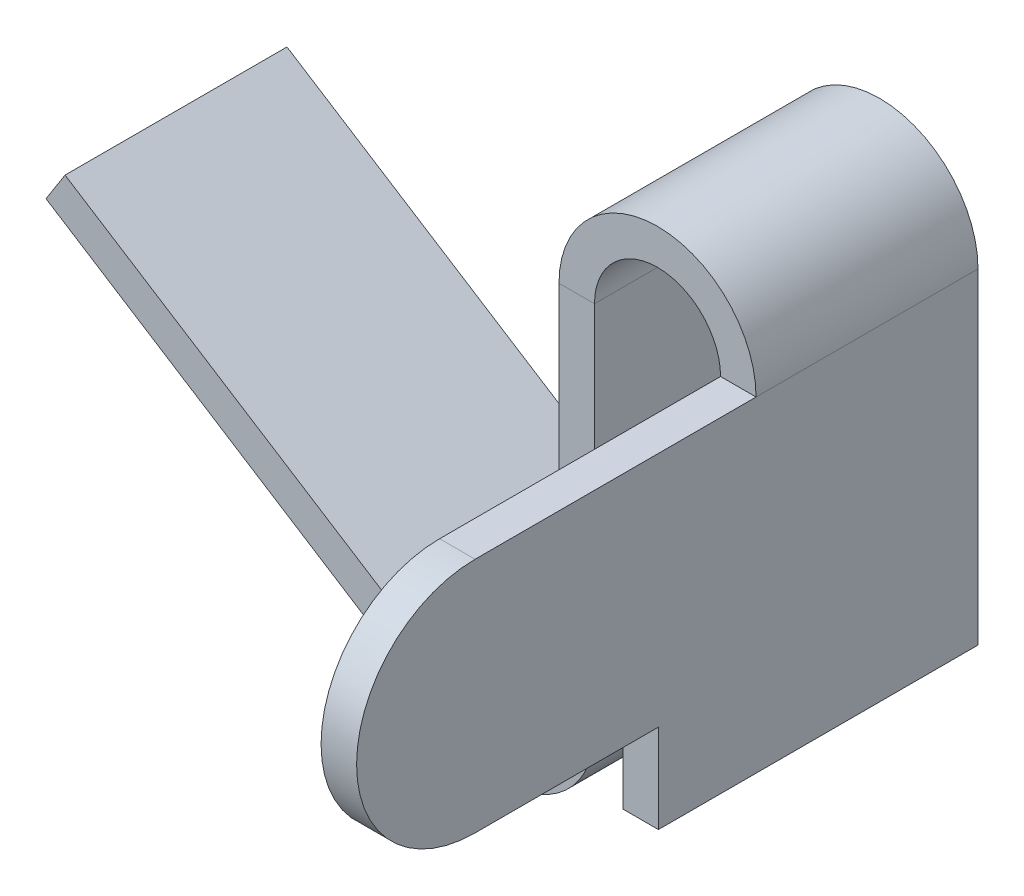
ISO-10303-21;
HEADER;
FILE_DESCRIPTION(('STEP AP214'),'2;1');
FILE_NAME('part.step','',(''),(''),'','','');
FILE_SCHEMA(('AUTOMOTIVE_DESIGN { 1 0 10303 214 1 1 1 1 }'));
ENDSEC;
DATA;
#1=APPLICATION_CONTEXT('core data for automotive mechanical design processes');
#2=APPLICATION_PROTOCOL_DEFINITION('international standard','automotive_design',2000,#1);
#3=PRODUCT_CONTEXT('',#1,'mechanical');
#4=PRODUCT('Part','Part','',(#3));
#5=PRODUCT_RELATED_PRODUCT_CATEGORY('part','',(#4));
#6=PRODUCT_DEFINITION_FORMATION('','',#4);
#7=PRODUCT_DEFINITION_CONTEXT('part definition',#1,'design');
#8=PRODUCT_DEFINITION('design','',#6,#7);
#9=PRODUCT_DEFINITION_SHAPE('','',#8);
#10=(LENGTH_UNIT() NAMED_UNIT(*) SI_UNIT(.MILLI.,.METRE.));
#11=(NAMED_UNIT(*) PLANE_ANGLE_UNIT() SI_UNIT($,.RADIAN.));
#12=(NAMED_UNIT(*) SI_UNIT($,.STERADIAN.) SOLID_ANGLE_UNIT());
#13=UNCERTAINTY_MEASURE_WITH_UNIT(LENGTH_MEASURE(1.E-05),#10,'distance_accuracy_value','');
#14=(GEOMETRIC_REPRESENTATION_CONTEXT(3) GLOBAL_UNCERTAINTY_ASSIGNED_CONTEXT((#13)) GLOBAL_UNIT_ASSIGNED_CONTEXT((#10,
#11,#12)) REPRESENTATION_CONTEXT('',''));
#15=CARTESIAN_POINT('',(0.,0.,0.));
#16=DIRECTION('',(0.,0.,1.));
#17=DIRECTION('',(1.,0.,0.));
#18=AXIS2_PLACEMENT_3D('',#15,#16,#17);
#19=CARTESIAN_POINT('',(20.1054210139582,7.32068373455989,39.1192773370868));
#20=DIRECTION('',(-1.,0.,0.));
#21=DIRECTION('',(0.,-1.,0.));
#22=AXIS2_PLACEMENT_3D('',#19,#20,#21);
#23=CYLINDRICAL_SURFACE('',#22,13.35);
#24=DIRECTION('',(1.,0.,0.));
#25=VECTOR('',#24,1.);
#26=CARTESIAN_POINT('',(20.1054210139582,-6.02931626544012,39.1192773370868));
#27=LINE('',#26,#25);
#28=CARTESIAN_POINT('',(20.1054210139582,-6.02931626544012,39.1192773370868));
#29=VERTEX_POINT('',#28);
#30=CARTESIAN_POINT('',(16.1054210139582,-6.02931626544012,39.1192773370868));
#31=VERTEX_POINT('',#30);
#32=EDGE_CURVE('E216',#29,#31,#27,.F.);
#33=ORIENTED_EDGE('',*,*,#32,.F.);
#34=CARTESIAN_POINT('',(20.1054210139582,7.32068373455989,39.1192773370868));
#35=DIRECTION('',(-1.,0.,0.));
#36=DIRECTION('',(0.,-1.,0.));
#37=AXIS2_PLACEMENT_3D('',#34,#35,#36);
#38=CIRCLE('',#37,13.35);
#39=CARTESIAN_POINT('',(20.1054210139582,20.6706837345599,39.1192773370868));
#40=VERTEX_POINT('',#39);
#41=EDGE_CURVE('E52',#40,#29,#38,.F.);
#42=ORIENTED_EDGE('',*,*,#41,.F.);
#43=DIRECTION('',(1.,0.,0.));
#44=VECTOR('',#43,1.);
#45=CARTESIAN_POINT('',(20.1054210139582,20.6706837345599,39.1192773370868));
#46=LINE('',#45,#44);
#47=CARTESIAN_POINT('',(16.1054210139582,20.6706837345599,39.1192773370868));
#48=VERTEX_POINT('',#47);
#49=EDGE_CURVE('E219',#48,#40,#46,.T.);
#50=ORIENTED_EDGE('',*,*,#49,.F.);
#51=CARTESIAN_POINT('',(16.1054210139582,7.32068373455989,39.1192773370868));
#52=DIRECTION('',(-1.,0.,0.));
#53=DIRECTION('',(0.,-1.,0.));
#54=AXIS2_PLACEMENT_3D('',#51,#52,#53);
#55=CIRCLE('',#54,13.35);
#56=EDGE_CURVE('E11',#31,#48,#55,.T.);
#57=ORIENTED_EDGE('',*,*,#56,.F.);
#58=EDGE_LOOP('',(#33,#42,#50,#57));
#59=FACE_BOUND('',#58,.T.);
#60=ADVANCED_FACE('F45',(#59),#23,.T.);
#61=CARTESIAN_POINT('',(1.90542101395821,20.6706837345599,7.46927733708683));
#62=DIRECTION('',(0.,0.,1.));
#63=DIRECTION('',(1.,0.,0.));
#64=AXIS2_PLACEMENT_3D('',#61,#62,#63);
#65=PLANE('',#64);
#66=DIRECTION('',(-1.,0.,0.));
#67=VECTOR('',#66,1.);
#68=CARTESIAN_POINT('',(1.90542101395821,20.6706837345599,7.46927733708683));
#69=LINE('',#68,#67);
#70=CARTESIAN_POINT('',(1.90542101395821,20.6706837345599,7.46927733708683));
#71=VERTEX_POINT('',#70);
#72=CARTESIAN_POINT('',(-2.09457898604179,20.6706837345599,7.46927733708683));
#73=VERTEX_POINT('',#72);
#74=EDGE_CURVE('E214',#71,#73,#69,.T.);
#75=ORIENTED_EDGE('',*,*,#74,.F.);
#76=CARTESIAN_POINT('',(9.00542101395822,20.6706837345599,7.46927733708683));
#77=DIRECTION('',(0.,0.,1.));
#78=DIRECTION('',(1.,0.,0.));
#79=AXIS2_PLACEMENT_3D('',#76,#77,#78);
#80=CIRCLE('',#79,7.10000000000001);
#81=CARTESIAN_POINT('',(16.1054210139582,20.6706837345599,7.46927733708683));
#82=VERTEX_POINT('',#81);
#83=EDGE_CURVE('E249',#82,#71,#80,.T.);
#84=ORIENTED_EDGE('',*,*,#83,.F.);
#85=DIRECTION('',(-1.,0.,0.));
#86=VECTOR('',#85,1.);
#87=CARTESIAN_POINT('',(20.1054210139582,20.6706837345599,7.46927733708683));
#88=LINE('',#87,#86);
#89=CARTESIAN_POINT('',(20.1054210139582,20.6706837345599,7.46927733708683));
#90=VERTEX_POINT('',#89);
#91=EDGE_CURVE('E211',#90,#82,#88,.T.);
#92=ORIENTED_EDGE('',*,*,#91,.F.);
#93=CARTESIAN_POINT('',(9.00542101395822,20.6706837345599,7.46927733708683));
#94=DIRECTION('',(0.,0.,1.));
#95=DIRECTION('',(1.,0.,0.));
#96=AXIS2_PLACEMENT_3D('',#93,#94,#95);
#97=CIRCLE('',#96,11.1);
#98=EDGE_CURVE('E252',#90,#73,#97,.T.);
#99=ORIENTED_EDGE('',*,*,#98,.T.);
#100=EDGE_LOOP('',(#75,#84,#92,#99));
#101=FACE_BOUND('',#100,.T.);
#102=ADVANCED_FACE('F348',(#101),#65,.T.);
#103=CARTESIAN_POINT('',(20.1054210139582,20.6706837345599,7.46927733708683));
#104=DIRECTION('',(0.,0.,1.));
#105=DIRECTION('',(1.,0.,0.));
#106=AXIS2_PLACEMENT_3D('',#103,#104,#105);
#107=PLANE('',#106);
#108=DIRECTION('',(0.,-1.,0.));
#109=VECTOR('',#108,1.);
#110=CARTESIAN_POINT('',(1.90542101395822,-21.0293162654401,7.46927733708683));
#111=LINE('',#110,#109);
#112=CARTESIAN_POINT('',(1.90542101395822,-21.0293162654401,7.46927733708683));
#113=VERTEX_POINT('',#112);
#114=EDGE_CURVE('E246',#71,#113,#111,.T.);
#115=ORIENTED_EDGE('',*,*,#114,.F.);
#116=ORIENTED_EDGE('',*,*,#74,.T.);
#117=DIRECTION('',(0.,-1.,0.));
#118=VECTOR('',#117,1.);
#119=CARTESIAN_POINT('',(-2.09457898604178,-21.0293162654401,7.46927733708683));
#120=LINE('',#119,#118);
#121=CARTESIAN_POINT('',(-2.09457898604178,-21.0293162654401,7.46927733708683));
#122=VERTEX_POINT('',#121);
#123=EDGE_CURVE('E255',#73,#122,#120,.T.);
#124=ORIENTED_EDGE('',*,*,#123,.T.);
#125=DIRECTION('',(1.,0.,0.));
#126=VECTOR('',#125,1.);
#127=CARTESIAN_POINT('',(-2.09457898604178,-21.0293162654401,7.46927733708683));
#128=LINE('',#127,#126);
#129=EDGE_CURVE('E203',#122,#113,#128,.T.);
#130=ORIENTED_EDGE('',*,*,#129,.T.);
#131=EDGE_LOOP('',(#115,#116,#124,#130));
#132=FACE_BOUND('',#131,.T.);
#133=ADVANCED_FACE('F344',(#132),#107,.T.);
#134=CARTESIAN_POINT('',(16.1054210139582,20.6706837345599,-17.5307226629132));
#135=DIRECTION('',(0.,0.,-1.));
#136=DIRECTION('',(-1.,0.,0.));
#137=AXIS2_PLACEMENT_3D('',#134,#135,#136);
#138=PLANE('',#137);
#139=DIRECTION('',(1.,0.,0.));
#140=VECTOR('',#139,1.);
#141=CARTESIAN_POINT('',(16.1054210139582,20.6706837345599,-17.5307226629132));
#142=LINE('',#141,#140);
#143=CARTESIAN_POINT('',(16.1054210139582,20.6706837345599,-17.5307226629132));
#144=VERTEX_POINT('',#143);
#145=CARTESIAN_POINT('',(20.1054210139582,20.6706837345599,-17.5307226629132));
#146=VERTEX_POINT('',#145);
#147=EDGE_CURVE('E209',#144,#146,#142,.T.);
#148=ORIENTED_EDGE('',*,*,#147,.F.);
#149=CARTESIAN_POINT('',(9.00542101395822,20.6706837345599,-17.5307226629132));
#150=DIRECTION('',(0.,0.,1.));
#151=DIRECTION('',(1.,0.,0.));
#152=AXIS2_PLACEMENT_3D('',#149,#150,#151);
#153=CIRCLE('',#152,7.10000000000001);
#154=CARTESIAN_POINT('',(1.90542101395821,20.6706837345599,-17.5307226629132));
#155=VERTEX_POINT('',#154);
#156=EDGE_CURVE('E276',#144,#155,#153,.T.);
#157=ORIENTED_EDGE('',*,*,#156,.T.);
#158=DIRECTION('',(1.,0.,0.));
#159=VECTOR('',#158,1.);
#160=CARTESIAN_POINT('',(-2.09457898604179,20.6706837345599,-17.5307226629132));
#161=LINE('',#160,#159);
#162=CARTESIAN_POINT('',(-2.09457898604179,20.6706837345599,-17.5307226629132));
#163=VERTEX_POINT('',#162);
#164=EDGE_CURVE('E207',#163,#155,#161,.T.);
#165=ORIENTED_EDGE('',*,*,#164,.F.);
#166=CARTESIAN_POINT('',(9.00542101395822,20.6706837345599,-17.5307226629132));
#167=DIRECTION('',(0.,0.,1.));
#168=DIRECTION('',(1.,0.,0.));
#169=AXIS2_PLACEMENT_3D('',#166,#167,#168);
#170=CIRCLE('',#169,11.1);
#171=EDGE_CURVE('E285',#146,#163,#170,.T.);
#172=ORIENTED_EDGE('',*,*,#171,.F.);
#173=EDGE_LOOP('',(#148,#157,#165,#172));
#174=FACE_BOUND('',#173,.T.);
#175=ADVANCED_FACE('F352',(#174),#138,.T.);
#176=CARTESIAN_POINT('',(-2.09457898604179,20.6706837345599,-17.5307226629132));
#177=DIRECTION('',(0.,0.,-1.));
#178=DIRECTION('',(-1.,0.,0.));
#179=AXIS2_PLACEMENT_3D('',#176,#177,#178);
#180=PLANE('',#179);
#181=DIRECTION('',(0.,1.,0.));
#182=VECTOR('',#181,1.);
#183=CARTESIAN_POINT('',(16.1054210139582,-16.0293162654401,-17.5307226629132));
#184=LINE('',#183,#182);
#185=CARTESIAN_POINT('',(16.1054210139582,-16.0293162654401,-17.5307226629132));
#186=VERTEX_POINT('',#185);
#187=EDGE_CURVE('E279',#186,#144,#184,.T.);
#188=ORIENTED_EDGE('',*,*,#187,.T.);
#189=ORIENTED_EDGE('',*,*,#147,.T.);
#190=DIRECTION('',(0.,1.,0.));
#191=VECTOR('',#190,1.);
#192=CARTESIAN_POINT('',(20.1054210139582,-16.0293162654401,-17.5307226629132));
#193=LINE('',#192,#191);
#194=CARTESIAN_POINT('',(20.1054210139582,-16.0293162654401,-17.5307226629132));
#195=VERTEX_POINT('',#194);
#196=EDGE_CURVE('E283',#195,#146,#193,.T.);
#197=ORIENTED_EDGE('',*,*,#196,.F.);
#198=DIRECTION('',(-1.,0.,0.));
#199=VECTOR('',#198,1.);
#200=CARTESIAN_POINT('',(20.1054210139582,-16.0293162654401,-17.5307226629132));
#201=LINE('',#200,#199);
#202=EDGE_CURVE('E173',#195,#186,#201,.T.);
#203=ORIENTED_EDGE('',*,*,#202,.T.);
#204=EDGE_LOOP('',(#188,#189,#197,#203));
#205=FACE_BOUND('',#204,.T.);
#206=ADVANCED_FACE('F359',(#205),#180,.T.);
#207=CARTESIAN_POINT('',(-13.4572670918099,-29.4697887806642,7.46927733708683));
#208=DIRECTION('',(0.,0.,1.));
#209=DIRECTION('',(1.,0.,0.));
#210=AXIS2_PLACEMENT_3D('',#207,#208,#209);
#211=PLANE('',#210);
#212=DIRECTION('',(0.536268810576813,0.844047251522408,0.));
#213=VECTOR('',#212,1.);
#214=CARTESIAN_POINT('',(-13.4572670918099,-29.4697887806642,7.46927733708683));
#215=LINE('',#214,#213);
#216=CARTESIAN_POINT('',(-13.4572670918099,-29.4697887806642,7.46927733708683));
#217=VERTEX_POINT('',#216);
#218=CARTESIAN_POINT('',(-11.3121918495027,-26.0935997745746,7.46927733708683));
#219=VERTEX_POINT('',#218);
#220=EDGE_CURVE('E205',#217,#219,#215,.T.);
#221=ORIENTED_EDGE('',*,*,#220,.F.);
#222=CARTESIAN_POINT('',(-8.09457898604178,-21.0293162654401,7.46927733708683));
#223=DIRECTION('',(0.,0.,-1.));
#224=DIRECTION('',(-1.,0.,0.));
#225=AXIS2_PLACEMENT_3D('',#222,#223,#224);
#226=CIRCLE('',#225,10.);
#227=EDGE_CURVE('E243',#113,#217,#226,.T.);
#228=ORIENTED_EDGE('',*,*,#227,.F.);
#229=ORIENTED_EDGE('',*,*,#129,.F.);
#230=CARTESIAN_POINT('',(-8.09457898604178,-21.0293162654401,7.46927733708683));
#231=DIRECTION('',(0.,0.,1.));
#232=DIRECTION('',(1.,0.,0.));
#233=AXIS2_PLACEMENT_3D('',#230,#231,#232);
#234=CIRCLE('',#233,6.);
#235=EDGE_CURVE('E258',#122,#219,#234,.F.);
#236=ORIENTED_EDGE('',*,*,#235,.T.);
#237=EDGE_LOOP('',(#221,#228,#229,#236));
#238=FACE_BOUND('',#237,.T.);
#239=ADVANCED_FACE('F342',(#238),#211,.T.);
#240=CARTESIAN_POINT('',(-2.09457898604178,-21.0293162654401,7.46927733708683));
#241=DIRECTION('',(0.,0.,1.));
#242=DIRECTION('',(1.,0.,0.));
#243=AXIS2_PLACEMENT_3D('',#240,#241,#242);
#244=PLANE('',#243);
#245=DIRECTION('',(-0.844047251522407,0.536268810576813,0.));
#246=VECTOR('',#245,1.);
#247=CARTESIAN_POINT('',(-13.4572670918099,-29.4697887806642,7.46927733708683));
#248=LINE('',#247,#246);
#249=CARTESIAN_POINT('',(-59.8798659255423,0.0249958010605287,7.46927733708683));
#250=VERTEX_POINT('',#249);
#251=EDGE_CURVE('E240',#217,#250,#248,.T.);
#252=ORIENTED_EDGE('',*,*,#251,.F.);
#253=ORIENTED_EDGE('',*,*,#220,.T.);
#254=DIRECTION('',(-0.844047251522407,0.536268810576813,0.));
#255=VECTOR('',#254,1.);
#256=CARTESIAN_POINT('',(-11.3121918495027,-26.0935997745746,7.46927733708683));
#257=LINE('',#256,#255);
#258=CARTESIAN_POINT('',(-57.7347906832351,3.40118480715016,7.46927733708683));
#259=VERTEX_POINT('',#258);
#260=EDGE_CURVE('E234',#219,#259,#257,.T.);
#261=ORIENTED_EDGE('',*,*,#260,.T.);
#262=DIRECTION('',(0.536268810576812,0.844047251522408,0.));
#263=VECTOR('',#262,1.);
#264=CARTESIAN_POINT('',(-59.8798659255423,0.0249958010605287,7.46927733708683));
#265=LINE('',#264,#263);
#266=EDGE_CURVE('E236',#250,#259,#265,.T.);
#267=ORIENTED_EDGE('',*,*,#266,.F.);
#268=EDGE_LOOP('',(#252,#253,#261,#267));
#269=FACE_BOUND('',#268,.T.);
#270=ADVANCED_FACE('F340',(#269),#244,.T.);
#271=CARTESIAN_POINT('',(1.90542101395822,-21.0293162654401,-17.5307226629132));
#272=DIRECTION('',(0.,0.,-1.));
#273=DIRECTION('',(-1.,0.,0.));
#274=AXIS2_PLACEMENT_3D('',#271,#272,#273);
#275=PLANE('',#274);
#276=DIRECTION('',(-1.,0.,0.));
#277=VECTOR('',#276,1.);
#278=CARTESIAN_POINT('',(1.90542101395822,-21.0293162654401,-17.5307226629132));
#279=LINE('',#278,#277);
#280=CARTESIAN_POINT('',(1.90542101395822,-21.0293162654401,-17.5307226629132));
#281=VERTEX_POINT('',#280);
#282=CARTESIAN_POINT('',(-2.09457898604178,-21.0293162654401,-17.5307226629132));
#283=VERTEX_POINT('',#282);
#284=EDGE_CURVE('E201',#281,#283,#279,.T.);
#285=ORIENTED_EDGE('',*,*,#284,.F.);
#286=CARTESIAN_POINT('',(-8.09457898604178,-21.0293162654401,-17.5307226629132));
#287=DIRECTION('',(0.,0.,-1.));
#288=DIRECTION('',(-1.,0.,0.));
#289=AXIS2_PLACEMENT_3D('',#286,#287,#288);
#290=CIRCLE('',#289,10.);
#291=CARTESIAN_POINT('',(-13.4572670918099,-29.4697887806642,-17.5307226629132));
#292=VERTEX_POINT('',#291);
#293=EDGE_CURVE('E270',#281,#292,#290,.T.);
#294=ORIENTED_EDGE('',*,*,#293,.T.);
#295=DIRECTION('',(-0.536268810576813,-0.844047251522408,0.));
#296=VECTOR('',#295,1.);
#297=CARTESIAN_POINT('',(-11.3121918495027,-26.0935997745746,-17.5307226629132));
#298=LINE('',#297,#296);
#299=CARTESIAN_POINT('',(-11.3121918495027,-26.0935997745746,-17.5307226629132));
#300=VERTEX_POINT('',#299);
#301=EDGE_CURVE('E199',#300,#292,#298,.T.);
#302=ORIENTED_EDGE('',*,*,#301,.F.);
#303=CARTESIAN_POINT('',(-8.09457898604178,-21.0293162654401,-17.5307226629132));
#304=DIRECTION('',(0.,0.,1.));
#305=DIRECTION('',(1.,0.,0.));
#306=AXIS2_PLACEMENT_3D('',#303,#304,#305);
#307=CIRCLE('',#306,6.);
#308=EDGE_CURVE('E237',#283,#300,#307,.F.);
#309=ORIENTED_EDGE('',*,*,#308,.F.);
#310=EDGE_LOOP('',(#285,#294,#302,#309));
#311=FACE_BOUND('',#310,.T.);
#312=ADVANCED_FACE('F311',(#311),#275,.T.);
#313=CARTESIAN_POINT('',(-11.3121918495027,-26.0935997745746,-17.5307226629132));
#314=DIRECTION('',(0.,0.,-1.));
#315=DIRECTION('',(-1.,0.,0.));
#316=AXIS2_PLACEMENT_3D('',#313,#314,#315);
#317=PLANE('',#316);
#318=DIRECTION('',(0.,-1.,0.));
#319=VECTOR('',#318,1.);
#320=CARTESIAN_POINT('',(1.90542101395822,-21.0293162654401,-17.5307226629132));
#321=LINE('',#320,#319);
#322=EDGE_CURVE('E273',#155,#281,#321,.T.);
#323=ORIENTED_EDGE('',*,*,#322,.T.);
#324=ORIENTED_EDGE('',*,*,#284,.T.);
#325=DIRECTION('',(0.,-1.,0.));
#326=VECTOR('',#325,1.);
#327=CARTESIAN_POINT('',(-2.09457898604178,-21.0293162654401,-17.5307226629132));
#328=LINE('',#327,#326);
#329=EDGE_CURVE('E288',#163,#283,#328,.T.);
#330=ORIENTED_EDGE('',*,*,#329,.F.);
#331=ORIENTED_EDGE('',*,*,#164,.T.);
#332=EDGE_LOOP('',(#323,#324,#330,#331));
#333=FACE_BOUND('',#332,.T.);
#334=ADVANCED_FACE('F307',(#333),#317,.T.);
#335=CARTESIAN_POINT('',(-11.3121918495027,-26.0935997745746,7.46927733708683));
#336=DIRECTION('',(-0.536268810576813,-0.844047251522407,0.));
#337=DIRECTION('',(0.844047251522407,-0.536268810576813,0.));
#338=AXIS2_PLACEMENT_3D('',#335,#336,#337);
#339=PLANE('',#338);
#340=DIRECTION('',(-0.844047251522407,0.536268810576813,0.));
#341=VECTOR('',#340,1.);
#342=CARTESIAN_POINT('',(-11.3121918495027,-26.0935997745746,-17.5307226629132));
#343=LINE('',#342,#341);
#344=CARTESIAN_POINT('',(-57.7347906832351,3.40118480715016,-17.5307226629132));
#345=VERTEX_POINT('',#344);
#346=EDGE_CURVE('E233',#300,#345,#343,.T.);
#347=ORIENTED_EDGE('',*,*,#346,.T.);
#348=DIRECTION('',(0.,0.,-1.));
#349=VECTOR('',#348,1.);
#350=CARTESIAN_POINT('',(-57.7347906832351,3.40118480715016,7.46927733708683));
#351=LINE('',#350,#349);
#352=EDGE_CURVE('E197',#259,#345,#351,.T.);
#353=ORIENTED_EDGE('',*,*,#352,.F.);
#354=ORIENTED_EDGE('',*,*,#260,.F.);
#355=DIRECTION('',(0.,0.,-1.));
#356=VECTOR('',#355,1.);
#357=CARTESIAN_POINT('',(-11.3121918495027,-26.0935997745746,7.46927733708683));
#358=LINE('',#357,#356);
#359=EDGE_CURVE('E261',#219,#300,#358,.T.);
#360=ORIENTED_EDGE('',*,*,#359,.T.);
#361=EDGE_LOOP('',(#347,#353,#354,#360));
#362=FACE_BOUND('',#361,.T.);
#363=ADVANCED_FACE('F336',(#362),#339,.F.);
#364=CARTESIAN_POINT('',(-59.8798659255423,0.0249958010605287,7.46927733708683));
#365=DIRECTION('',(-0.844047251522408,0.536268810576812,0.));
#366=DIRECTION('',(-0.536268810576812,-0.844047251522408,0.));
#367=AXIS2_PLACEMENT_3D('',#364,#365,#366);
#368=PLANE('',#367);
#369=DIRECTION('',(0.536268810576812,0.844047251522408,0.));
#370=VECTOR('',#369,1.);
#371=CARTESIAN_POINT('',(-59.8798659255423,0.0249958010605287,-17.5307226629132));
#372=LINE('',#371,#370);
#373=CARTESIAN_POINT('',(-59.8798659255423,0.0249958010605287,-17.5307226629132));
#374=VERTEX_POINT('',#373);
#375=EDGE_CURVE('E264',#374,#345,#372,.T.);
#376=ORIENTED_EDGE('',*,*,#375,.F.);
#377=DIRECTION('',(0.,0.,-1.));
#378=VECTOR('',#377,1.);
#379=CARTESIAN_POINT('',(-59.8798659255423,0.0249958010605287,7.46927733708683));
#380=LINE('',#379,#378);
#381=EDGE_CURVE('E195',#250,#374,#380,.T.);
#382=ORIENTED_EDGE('',*,*,#381,.F.);
#383=ORIENTED_EDGE('',*,*,#266,.T.);
#384=ORIENTED_EDGE('',*,*,#352,.T.);
#385=EDGE_LOOP('',(#376,#382,#383,#384));
#386=FACE_BOUND('',#385,.T.);
#387=ADVANCED_FACE('F396',(#386),#368,.T.);
#388=CARTESIAN_POINT('',(-13.4572670918099,-29.4697887806642,7.46927733708683));
#389=DIRECTION('',(-0.536268810576813,-0.844047251522407,0.));
#390=DIRECTION('',(0.844047251522407,-0.536268810576813,0.));
#391=AXIS2_PLACEMENT_3D('',#388,#389,#390);
#392=PLANE('',#391);
#393=DIRECTION('',(-0.844047251522407,0.536268810576813,0.));
#394=VECTOR('',#393,1.);
#395=CARTESIAN_POINT('',(-13.4572670918099,-29.4697887806642,-17.5307226629132));
#396=LINE('',#395,#394);
#397=EDGE_CURVE('E267',#292,#374,#396,.T.);
#398=ORIENTED_EDGE('',*,*,#397,.F.);
#399=DIRECTION('',(0.,0.,-1.));
#400=VECTOR('',#399,1.);
#401=CARTESIAN_POINT('',(-13.4572670918099,-29.4697887806642,7.46927733708683));
#402=LINE('',#401,#400);
#403=EDGE_CURVE('E192',#217,#292,#402,.T.);
#404=ORIENTED_EDGE('',*,*,#403,.F.);
#405=ORIENTED_EDGE('',*,*,#251,.T.);
#406=ORIENTED_EDGE('',*,*,#381,.T.);
#407=EDGE_LOOP('',(#398,#404,#405,#406));
#408=FACE_BOUND('',#407,.T.);
#409=ADVANCED_FACE('F325',(#408),#392,.T.);
#410=CARTESIAN_POINT('',(-8.09457898604178,-21.0293162654401,7.46927733708683));
#411=DIRECTION('',(0.,0.,-1.));
#412=DIRECTION('',(-1.,0.,0.));
#413=AXIS2_PLACEMENT_3D('',#410,#411,#412);
#414=CYLINDRICAL_SURFACE('',#413,10.);
#415=ORIENTED_EDGE('',*,*,#293,.F.);
#416=DIRECTION('',(0.,0.,-1.));
#417=VECTOR('',#416,1.);
#418=CARTESIAN_POINT('',(1.90542101395822,-21.0293162654401,7.46927733708683));
#419=LINE('',#418,#417);
#420=EDGE_CURVE('E189',#113,#281,#419,.T.);
#421=ORIENTED_EDGE('',*,*,#420,.F.);
#422=ORIENTED_EDGE('',*,*,#227,.T.);
#423=ORIENTED_EDGE('',*,*,#403,.T.);
#424=EDGE_LOOP('',(#415,#421,#422,#423));
#425=FACE_BOUND('',#424,.T.);
#426=ADVANCED_FACE('F320',(#425),#414,.T.);
#427=CARTESIAN_POINT('',(1.90542101395822,-21.0293162654401,7.46927733708683));
#428=DIRECTION('',(1.,0.,0.));
#429=DIRECTION('',(0.,1.,0.));
#430=AXIS2_PLACEMENT_3D('',#427,#428,#429);
#431=PLANE('',#430);
#432=ORIENTED_EDGE('',*,*,#322,.F.);
#433=DIRECTION('',(0.,0.,-1.));
#434=VECTOR('',#433,1.);
#435=CARTESIAN_POINT('',(1.90542101395821,20.6706837345599,7.46927733708683));
#436=LINE('',#435,#434);
#437=EDGE_CURVE('E186',#71,#155,#436,.T.);
#438=ORIENTED_EDGE('',*,*,#437,.F.);
#439=ORIENTED_EDGE('',*,*,#114,.T.);
#440=ORIENTED_EDGE('',*,*,#420,.T.);
#441=EDGE_LOOP('',(#432,#438,#439,#440));
#442=FACE_BOUND('',#441,.T.);
#443=ADVANCED_FACE('F315',(#442),#431,.T.);
#444=CARTESIAN_POINT('',(9.00542101395822,20.6706837345599,7.46927733708683));
#445=DIRECTION('',(0.,0.,-1.));
#446=DIRECTION('',(-1.,0.,0.));
#447=AXIS2_PLACEMENT_3D('',#444,#445,#446);
#448=CYLINDRICAL_SURFACE('',#447,7.10000000000001);
#449=ORIENTED_EDGE('',*,*,#156,.F.);
#450=DIRECTION('',(0.,0.,-1.));
#451=VECTOR('',#450,1.);
#452=CARTESIAN_POINT('',(16.1054210139582,20.6706837345599,7.46927733708683));
#453=LINE('',#452,#451);
#454=EDGE_CURVE('E177',#82,#144,#453,.T.);
#455=ORIENTED_EDGE('',*,*,#454,.F.);
#456=ORIENTED_EDGE('',*,*,#83,.T.);
#457=ORIENTED_EDGE('',*,*,#437,.T.);
#458=EDGE_LOOP('',(#449,#455,#456,#457));
#459=FACE_BOUND('',#458,.T.);
#460=ADVANCED_FACE('F356',(#459),#448,.F.);
#461=CARTESIAN_POINT('',(16.1054210139582,-16.0293162654401,7.46927733708683));
#462=DIRECTION('',(-1.,0.,0.));
#463=DIRECTION('',(0.,-1.,0.));
#464=AXIS2_PLACEMENT_3D('',#461,#462,#463);
#465=PLANE('',#464);
#466=DIRECTION('',(0.,0.,-1.));
#467=VECTOR('',#466,1.);
#468=CARTESIAN_POINT('',(16.1054210139582,-6.02931626544012,7.46927733708683));
#469=LINE('',#468,#467);
#470=CARTESIAN_POINT('',(16.1054210139582,-6.02931626544012,18.4692773370868));
#471=VERTEX_POINT('',#470);
#472=EDGE_CURVE('E226',#31,#471,#469,.T.);
#473=ORIENTED_EDGE('',*,*,#472,.F.);
#474=ORIENTED_EDGE('',*,*,#56,.T.);
#475=DIRECTION('',(0.,0.,-1.));
#476=VECTOR('',#475,1.);
#477=CARTESIAN_POINT('',(16.1054210139582,20.6706837345599,52.4692773370868));
#478=LINE('',#477,#476);
#479=EDGE_CURVE('E230',#48,#82,#478,.T.);
#480=ORIENTED_EDGE('',*,*,#479,.T.);
#481=ORIENTED_EDGE('',*,*,#454,.T.);
#482=ORIENTED_EDGE('',*,*,#187,.F.);
#483=DIRECTION('',(0.,0.,-1.));
#484=VECTOR('',#483,1.);
#485=CARTESIAN_POINT('',(16.1054210139582,-16.0293162654401,7.46927733708683));
#486=LINE('',#485,#484);
#487=CARTESIAN_POINT('',(16.1054210139582,-16.0293162654401,18.4692773370868));
#488=VERTEX_POINT('',#487);
#489=EDGE_CURVE('E174',#488,#186,#486,.T.);
#490=ORIENTED_EDGE('',*,*,#489,.F.);
#491=DIRECTION('',(0.,-1.,0.));
#492=VECTOR('',#491,1.);
#493=CARTESIAN_POINT('',(16.1054210139582,-16.0293162654401,18.4692773370868));
#494=LINE('',#493,#492);
#495=EDGE_CURVE('E155',#471,#488,#494,.T.);
#496=ORIENTED_EDGE('',*,*,#495,.F.);
#497=EDGE_LOOP('',(#473,#474,#480,#481,#482,#490,#496));
#498=FACE_BOUND('',#497,.T.);
#499=ADVANCED_FACE('F360',(#498),#465,.T.);
#500=CARTESIAN_POINT('',(20.1054210139582,-16.0293162654401,7.46927733708683));
#501=DIRECTION('',(0.,-1.,0.));
#502=DIRECTION('',(0.,0.,-1.));
#503=AXIS2_PLACEMENT_3D('',#500,#501,#502);
#504=PLANE('',#503);
#505=DIRECTION('',(1.,0.,0.));
#506=VECTOR('',#505,1.);
#507=CARTESIAN_POINT('',(-59.8798659255423,-16.0293162654401,18.4692773370868));
#508=LINE('',#507,#506);
#509=CARTESIAN_POINT('',(20.1054210139582,-16.0293162654401,18.4692773370868));
#510=VERTEX_POINT('',#509);
#511=EDGE_CURVE('E148',#488,#510,#508,.T.);
#512=ORIENTED_EDGE('',*,*,#511,.F.);
#513=ORIENTED_EDGE('',*,*,#489,.T.);
#514=ORIENTED_EDGE('',*,*,#202,.F.);
#515=DIRECTION('',(0.,0.,-1.));
#516=VECTOR('',#515,1.);
#517=CARTESIAN_POINT('',(20.1054210139582,-16.0293162654401,7.46927733708683));
#518=LINE('',#517,#516);
#519=EDGE_CURVE('E166',#510,#195,#518,.T.);
#520=ORIENTED_EDGE('',*,*,#519,.F.);
#521=EDGE_LOOP('',(#512,#513,#514,#520));
#522=FACE_BOUND('',#521,.T.);
#523=ADVANCED_FACE('F171',(#522),#504,.T.);
#524=CARTESIAN_POINT('',(20.1054210139582,-16.0293162654401,7.46927733708683));
#525=DIRECTION('',(-1.,0.,0.));
#526=DIRECTION('',(0.,-1.,0.));
#527=AXIS2_PLACEMENT_3D('',#524,#525,#526);
#528=PLANE('',#527);
#529=DIRECTION('',(0.,0.,-1.));
#530=VECTOR('',#529,1.);
#531=CARTESIAN_POINT('',(20.1054210139582,20.6706837345599,52.4692773370868));
#532=LINE('',#531,#530);
#533=EDGE_CURVE('E221',#40,#90,#532,.T.);
#534=ORIENTED_EDGE('',*,*,#533,.F.);
#535=ORIENTED_EDGE('',*,*,#41,.T.);
#536=DIRECTION('',(0.,0.,1.));
#537=VECTOR('',#536,1.);
#538=CARTESIAN_POINT('',(20.1054210139582,-6.02931626544012,52.4692773370868));
#539=LINE('',#538,#537);
#540=CARTESIAN_POINT('',(20.1054210139582,-6.02931626544012,18.4692773370868));
#541=VERTEX_POINT('',#540);
#542=EDGE_CURVE('E160',#541,#29,#539,.T.);
#543=ORIENTED_EDGE('',*,*,#542,.F.);
#544=DIRECTION('',(0.,1.,0.));
#545=VECTOR('',#544,1.);
#546=CARTESIAN_POINT('',(20.1054210139582,-16.0293162654401,18.4692773370868));
#547=LINE('',#546,#545);
#548=EDGE_CURVE('E152',#510,#541,#547,.T.);
#549=ORIENTED_EDGE('',*,*,#548,.F.);
#550=ORIENTED_EDGE('',*,*,#519,.T.);
#551=ORIENTED_EDGE('',*,*,#196,.T.);
#552=DIRECTION('',(0.,0.,-1.));
#553=VECTOR('',#552,1.);
#554=CARTESIAN_POINT('',(20.1054210139582,20.6706837345599,7.46927733708683));
#555=LINE('',#554,#553);
#556=EDGE_CURVE('E175',#90,#146,#555,.T.);
#557=ORIENTED_EDGE('',*,*,#556,.F.);
#558=EDGE_LOOP('',(#534,#535,#543,#549,#550,#551,#557));
#559=FACE_BOUND('',#558,.T.);
#560=ADVANCED_FACE('F164',(#559),#528,.F.);
#561=CARTESIAN_POINT('',(9.00542101395822,20.6706837345599,7.46927733708683));
#562=DIRECTION('',(0.,0.,-1.));
#563=DIRECTION('',(-1.,0.,0.));
#564=AXIS2_PLACEMENT_3D('',#561,#562,#563);
#565=CYLINDRICAL_SURFACE('',#564,11.1);
#566=ORIENTED_EDGE('',*,*,#171,.T.);
#567=DIRECTION('',(0.,0.,-1.));
#568=VECTOR('',#567,1.);
#569=CARTESIAN_POINT('',(-2.09457898604179,20.6706837345599,7.46927733708683));
#570=LINE('',#569,#568);
#571=EDGE_CURVE('E180',#73,#163,#570,.T.);
#572=ORIENTED_EDGE('',*,*,#571,.F.);
#573=ORIENTED_EDGE('',*,*,#98,.F.);
#574=ORIENTED_EDGE('',*,*,#556,.T.);
#575=EDGE_LOOP('',(#566,#572,#573,#574));
#576=FACE_BOUND('',#575,.T.);
#577=ADVANCED_FACE('F349',(#576),#565,.T.);
#578=CARTESIAN_POINT('',(-2.09457898604178,-21.0293162654401,7.46927733708683));
#579=DIRECTION('',(1.,0.,0.));
#580=DIRECTION('',(0.,1.,0.));
#581=AXIS2_PLACEMENT_3D('',#578,#579,#580);
#582=PLANE('',#581);
#583=ORIENTED_EDGE('',*,*,#329,.T.);
#584=DIRECTION('',(0.,0.,-1.));
#585=VECTOR('',#584,1.);
#586=CARTESIAN_POINT('',(-2.09457898604178,-21.0293162654401,7.46927733708683));
#587=LINE('',#586,#585);
#588=EDGE_CURVE('E295',#122,#283,#587,.T.);
#589=ORIENTED_EDGE('',*,*,#588,.F.);
#590=ORIENTED_EDGE('',*,*,#123,.F.);
#591=ORIENTED_EDGE('',*,*,#571,.T.);
#592=EDGE_LOOP('',(#583,#589,#590,#591));
#593=FACE_BOUND('',#592,.T.);
#594=ADVANCED_FACE('F302',(#593),#582,.F.);
#595=CARTESIAN_POINT('',(-8.09457898604178,-21.0293162654401,7.46927733708683));
#596=DIRECTION('',(0.,0.,-1.));
#597=DIRECTION('',(-1.,0.,0.));
#598=AXIS2_PLACEMENT_3D('',#595,#596,#597);
#599=CYLINDRICAL_SURFACE('',#598,6.);
#600=ORIENTED_EDGE('',*,*,#308,.T.);
#601=ORIENTED_EDGE('',*,*,#359,.F.);
#602=ORIENTED_EDGE('',*,*,#235,.F.);
#603=ORIENTED_EDGE('',*,*,#588,.T.);
#604=EDGE_LOOP('',(#600,#601,#602,#603));
#605=FACE_BOUND('',#604,.T.);
#606=ADVANCED_FACE('F332',(#605),#599,.F.);
#607=CARTESIAN_POINT('',(-8.09457898604178,-21.0293162654401,-17.5307226629132));
#608=DIRECTION('',(0.,0.,-1.));
#609=DIRECTION('',(-1.,0.,0.));
#610=AXIS2_PLACEMENT_3D('',#607,#608,#609);
#611=PLANE('',#610);
#612=ORIENTED_EDGE('',*,*,#346,.F.);
#613=ORIENTED_EDGE('',*,*,#301,.T.);
#614=ORIENTED_EDGE('',*,*,#397,.T.);
#615=ORIENTED_EDGE('',*,*,#375,.T.);
#616=EDGE_LOOP('',(#612,#613,#614,#615));
#617=FACE_BOUND('',#616,.T.);
#618=ADVANCED_FACE('F329',(#617),#611,.T.);
#619=CARTESIAN_POINT('',(20.1054210139582,20.6706837345599,52.4692773370868));
#620=DIRECTION('',(0.,-1.,0.));
#621=DIRECTION('',(1.,0.,0.));
#622=AXIS2_PLACEMENT_3D('',#619,#620,#621);
#623=PLANE('',#622);
#624=ORIENTED_EDGE('',*,*,#479,.F.);
#625=ORIENTED_EDGE('',*,*,#49,.T.);
#626=ORIENTED_EDGE('',*,*,#533,.T.);
#627=ORIENTED_EDGE('',*,*,#91,.T.);
#628=EDGE_LOOP('',(#624,#625,#626,#627));
#629=FACE_BOUND('',#628,.T.);
#630=ADVANCED_FACE('F363',(#629),#623,.F.);
#631=CARTESIAN_POINT('',(-59.8798659255423,-6.02931626544013,52.4692773370868));
#632=DIRECTION('',(0.,1.,0.));
#633=DIRECTION('',(-1.,0.,0.));
#634=AXIS2_PLACEMENT_3D('',#631,#632,#633);
#635=PLANE('',#634);
#636=ORIENTED_EDGE('',*,*,#542,.T.);
#637=ORIENTED_EDGE('',*,*,#32,.T.);
#638=ORIENTED_EDGE('',*,*,#472,.T.);
#639=DIRECTION('',(1.,0.,0.));
#640=VECTOR('',#639,1.);
#641=CARTESIAN_POINT('',(-59.8798659255423,-6.02931626544013,18.4692773370868));
#642=LINE('',#641,#640);
#643=EDGE_CURVE('E159',#471,#541,#642,.T.);
#644=ORIENTED_EDGE('',*,*,#643,.T.);
#645=EDGE_LOOP('',(#636,#637,#638,#644));
#646=FACE_BOUND('',#645,.T.);
#647=ADVANCED_FACE('F223',(#646),#635,.F.);
#648=CARTESIAN_POINT('',(-59.8798659255423,-16.0293162654401,18.4692773370868));
#649=DIRECTION('',(0.,0.,-1.));
#650=DIRECTION('',(-1.,0.,0.));
#651=AXIS2_PLACEMENT_3D('',#648,#649,#650);
#652=PLANE('',#651);
#653=ORIENTED_EDGE('',*,*,#495,.T.);
#654=ORIENTED_EDGE('',*,*,#511,.T.);
#655=ORIENTED_EDGE('',*,*,#548,.T.);
#656=ORIENTED_EDGE('',*,*,#643,.F.);
#657=EDGE_LOOP('',(#653,#654,#655,#656));
#658=FACE_BOUND('',#657,.T.);
#659=ADVANCED_FACE('F150',(#658),#652,.F.);
#660=CLOSED_SHELL('',(#60,#102,#133,#175,#206,#239,#270,#312,#334,#363,#387,#409,#426,#443,#460,
#499,#523,#560,#577,#594,#606,#618,#630,#647,#659));
#661=MANIFOLD_SOLID_BREP('B2',#660);
#662=ADVANCED_BREP_SHAPE_REPRESENTATION('',(#18,#661),#14);
#663=SHAPE_DEFINITION_REPRESENTATION(#9,#662);
ENDSEC;
END-ISO-10303-21;
